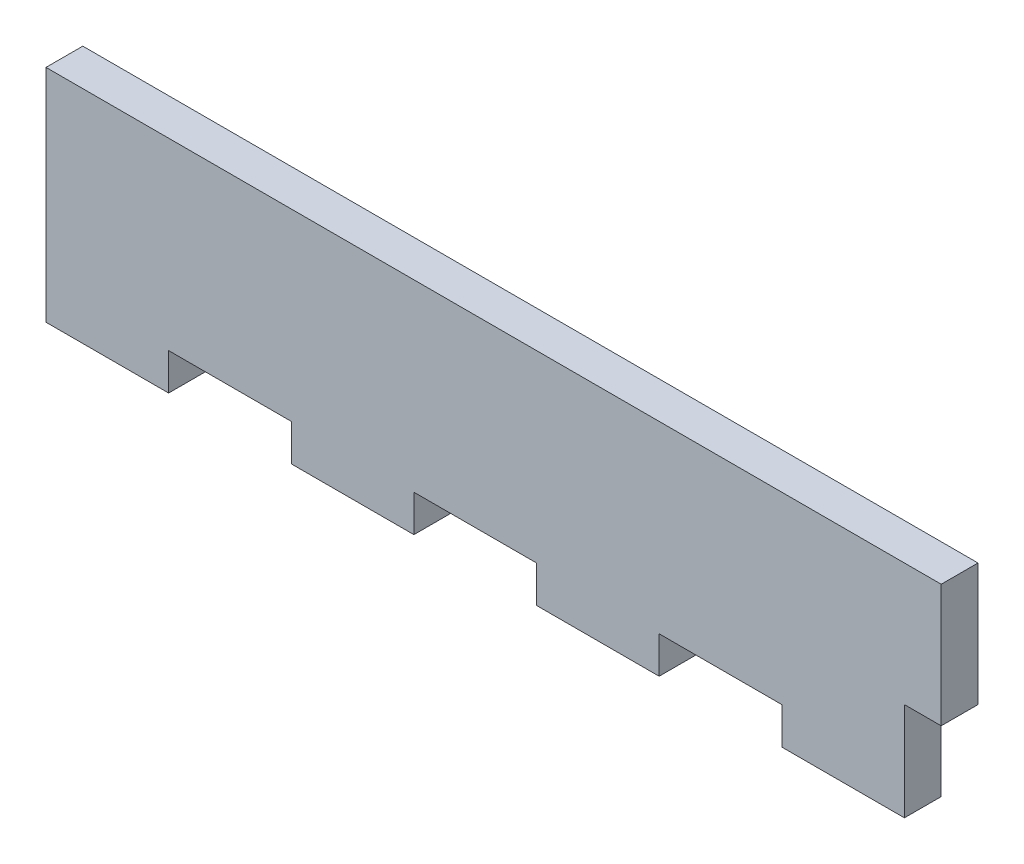
ISO-10303-21;
HEADER;
FILE_DESCRIPTION(('STEP AP214'),'2;1');
FILE_NAME('part.step','',(''),(''),'','','');
FILE_SCHEMA(('AUTOMOTIVE_DESIGN { 1 0 10303 214 1 1 1 1 }'));
ENDSEC;
DATA;
#1=APPLICATION_CONTEXT('core data for automotive mechanical design processes');
#2=APPLICATION_PROTOCOL_DEFINITION('international standard','automotive_design',2000,#1);
#3=PRODUCT_CONTEXT('',#1,'mechanical');
#4=PRODUCT('Part','Part','',(#3));
#5=PRODUCT_RELATED_PRODUCT_CATEGORY('part','',(#4));
#6=PRODUCT_DEFINITION_FORMATION('','',#4);
#7=PRODUCT_DEFINITION_CONTEXT('part definition',#1,'design');
#8=PRODUCT_DEFINITION('design','',#6,#7);
#9=PRODUCT_DEFINITION_SHAPE('','',#8);
#10=(LENGTH_UNIT() NAMED_UNIT(*) SI_UNIT(.MILLI.,.METRE.));
#11=(NAMED_UNIT(*) PLANE_ANGLE_UNIT() SI_UNIT($,.RADIAN.));
#12=(NAMED_UNIT(*) SI_UNIT($,.STERADIAN.) SOLID_ANGLE_UNIT());
#13=UNCERTAINTY_MEASURE_WITH_UNIT(LENGTH_MEASURE(1.E-05),#10,'distance_accuracy_value','');
#14=(GEOMETRIC_REPRESENTATION_CONTEXT(3) GLOBAL_UNCERTAINTY_ASSIGNED_CONTEXT((#13)) GLOBAL_UNIT_ASSIGNED_CONTEXT((#10,
#11,#12)) REPRESENTATION_CONTEXT('',''));
#15=CARTESIAN_POINT('',(0.,0.,0.));
#16=DIRECTION('',(0.,0.,1.));
#17=DIRECTION('',(1.,0.,0.));
#18=AXIS2_PLACEMENT_3D('',#15,#16,#17);
#19=CARTESIAN_POINT('',(70.,0.,3.));
#20=DIRECTION('',(-1.,0.,0.));
#21=DIRECTION('',(0.,0.,1.));
#22=AXIS2_PLACEMENT_3D('',#19,#20,#21);
#23=PLANE('',#22);
#24=DIRECTION('',(0.,0.,-1.));
#25=VECTOR('',#24,1.);
#26=CARTESIAN_POINT('',(70.,-10.,3.));
#27=LINE('',#26,#25);
#28=CARTESIAN_POINT('',(70.,-10.,3.));
#29=VERTEX_POINT('',#28);
#30=CARTESIAN_POINT('',(70.,-10.,0.));
#31=VERTEX_POINT('',#30);
#32=EDGE_CURVE('E50',#29,#31,#27,.T.);
#33=ORIENTED_EDGE('',*,*,#32,.F.);
#34=DIRECTION('',(0.,1.,0.));
#35=VECTOR('',#34,1.);
#36=CARTESIAN_POINT('',(70.,0.,3.));
#37=LINE('',#36,#35);
#38=CARTESIAN_POINT('',(70.,-18.,3.));
#39=VERTEX_POINT('',#38);
#40=EDGE_CURVE('E183',#39,#29,#37,.T.);
#41=ORIENTED_EDGE('',*,*,#40,.F.);
#42=DIRECTION('',(0.,0.,-1.));
#43=VECTOR('',#42,1.);
#44=CARTESIAN_POINT('',(70.,-18.,3.));
#45=LINE('',#44,#43);
#46=CARTESIAN_POINT('',(70.,-18.,0.));
#47=VERTEX_POINT('',#46);
#48=EDGE_CURVE('E43',#39,#47,#45,.T.);
#49=ORIENTED_EDGE('',*,*,#48,.T.);
#50=DIRECTION('',(0.,1.,0.));
#51=VECTOR('',#50,1.);
#52=CARTESIAN_POINT('',(70.,0.,0.));
#53=LINE('',#52,#51);
#54=EDGE_CURVE('E286',#47,#31,#53,.T.);
#55=ORIENTED_EDGE('',*,*,#54,.T.);
#56=EDGE_LOOP('',(#33,#41,#49,#55));
#57=FACE_BOUND('',#56,.T.);
#58=ADVANCED_FACE('F35',(#57),#23,.F.);
#59=CARTESIAN_POINT('',(0.,-18.,3.));
#60=DIRECTION('',(0.,1.,0.));
#61=DIRECTION('',(0.,0.,1.));
#62=AXIS2_PLACEMENT_3D('',#59,#60,#61);
#63=PLANE('',#62);
#64=DIRECTION('',(1.,0.,0.));
#65=VECTOR('',#64,1.);
#66=CARTESIAN_POINT('',(0.,-18.,3.));
#67=LINE('',#66,#65);
#68=CARTESIAN_POINT('',(40.,-18.,3.));
#69=VERTEX_POINT('',#68);
#70=CARTESIAN_POINT('',(50.,-18.,3.));
#71=VERTEX_POINT('',#70);
#72=EDGE_CURVE('E275',#69,#71,#67,.T.);
#73=ORIENTED_EDGE('',*,*,#72,.F.);
#74=DIRECTION('',(0.,0.,1.));
#75=VECTOR('',#74,1.);
#76=CARTESIAN_POINT('',(40.,-18.,0.));
#77=LINE('',#76,#75);
#78=CARTESIAN_POINT('',(40.,-18.,0.));
#79=VERTEX_POINT('',#78);
#80=EDGE_CURVE('E209',#79,#69,#77,.T.);
#81=ORIENTED_EDGE('',*,*,#80,.F.);
#82=DIRECTION('',(1.,0.,0.));
#83=VECTOR('',#82,1.);
#84=CARTESIAN_POINT('',(0.,-18.,0.));
#85=LINE('',#84,#83);
#86=CARTESIAN_POINT('',(50.,-18.,0.));
#87=VERTEX_POINT('',#86);
#88=EDGE_CURVE('E288',#79,#87,#85,.T.);
#89=ORIENTED_EDGE('',*,*,#88,.T.);
#90=DIRECTION('',(0.,0.,1.));
#91=VECTOR('',#90,1.);
#92=CARTESIAN_POINT('',(50.,-18.,0.));
#93=LINE('',#92,#91);
#94=EDGE_CURVE('E260',#87,#71,#93,.T.);
#95=ORIENTED_EDGE('',*,*,#94,.T.);
#96=EDGE_LOOP('',(#73,#81,#89,#95));
#97=FACE_BOUND('',#96,.T.);
#98=ADVANCED_FACE('F346',(#97),#63,.F.);
#99=CARTESIAN_POINT('',(20.,-18.,0.));
#100=VERTEX_POINT('',#99);
#101=CARTESIAN_POINT('',(30.,-18.,0.));
#102=VERTEX_POINT('',#101);
#103=EDGE_CURVE('E287',#100,#102,#85,.T.);
#104=ORIENTED_EDGE('',*,*,#103,.T.);
#105=DIRECTION('',(0.,0.,1.));
#106=VECTOR('',#105,1.);
#107=CARTESIAN_POINT('',(30.,-18.,0.));
#108=LINE('',#107,#106);
#109=CARTESIAN_POINT('',(30.,-18.,3.));
#110=VERTEX_POINT('',#109);
#111=EDGE_CURVE('E212',#102,#110,#108,.T.);
#112=ORIENTED_EDGE('',*,*,#111,.T.);
#113=CARTESIAN_POINT('',(20.,-18.,3.));
#114=VERTEX_POINT('',#113);
#115=EDGE_CURVE('E274',#114,#110,#67,.T.);
#116=ORIENTED_EDGE('',*,*,#115,.F.);
#117=DIRECTION('',(0.,0.,1.));
#118=VECTOR('',#117,1.);
#119=CARTESIAN_POINT('',(20.,-18.,0.));
#120=LINE('',#119,#118);
#121=EDGE_CURVE('E205',#100,#114,#120,.T.);
#122=ORIENTED_EDGE('',*,*,#121,.F.);
#123=EDGE_LOOP('',(#104,#112,#116,#122));
#124=FACE_BOUND('',#123,.T.);
#125=ADVANCED_FACE('F329',(#124),#63,.F.);
#126=CARTESIAN_POINT('',(60.,-18.,3.));
#127=VERTEX_POINT('',#126);
#128=EDGE_CURVE('E269',#127,#39,#67,.T.);
#129=ORIENTED_EDGE('',*,*,#128,.F.);
#130=DIRECTION('',(0.,0.,1.));
#131=VECTOR('',#130,1.);
#132=CARTESIAN_POINT('',(60.,-18.,0.));
#133=LINE('',#132,#131);
#134=CARTESIAN_POINT('',(60.,-18.,0.));
#135=VERTEX_POINT('',#134);
#136=EDGE_CURVE('E257',#135,#127,#133,.T.);
#137=ORIENTED_EDGE('',*,*,#136,.F.);
#138=EDGE_CURVE('E282',#135,#47,#85,.T.);
#139=ORIENTED_EDGE('',*,*,#138,.T.);
#140=ORIENTED_EDGE('',*,*,#48,.F.);
#141=EDGE_LOOP('',(#129,#137,#139,#140));
#142=FACE_BOUND('',#141,.T.);
#143=ADVANCED_FACE('F333',(#142),#63,.F.);
#144=CARTESIAN_POINT('',(0.,0.,3.));
#145=DIRECTION('',(1.,0.,0.));
#146=DIRECTION('',(0.,1.,0.));
#147=AXIS2_PLACEMENT_3D('',#144,#145,#146);
#148=PLANE('',#147);
#149=DIRECTION('',(0.,-1.,0.));
#150=VECTOR('',#149,1.);
#151=CARTESIAN_POINT('',(0.,0.,0.));
#152=LINE('',#151,#150);
#153=CARTESIAN_POINT('',(0.,0.,0.));
#154=VERTEX_POINT('',#153);
#155=CARTESIAN_POINT('',(0.,-18.,0.));
#156=VERTEX_POINT('',#155);
#157=EDGE_CURVE('E259',#154,#156,#152,.T.);
#158=ORIENTED_EDGE('',*,*,#157,.T.);
#159=DIRECTION('',(0.,0.,-1.));
#160=VECTOR('',#159,1.);
#161=CARTESIAN_POINT('',(0.,-18.,3.));
#162=LINE('',#161,#160);
#163=CARTESIAN_POINT('',(0.,-18.,3.));
#164=VERTEX_POINT('',#163);
#165=EDGE_CURVE('E11',#164,#156,#162,.T.);
#166=ORIENTED_EDGE('',*,*,#165,.F.);
#167=DIRECTION('',(0.,-1.,0.));
#168=VECTOR('',#167,1.);
#169=CARTESIAN_POINT('',(0.,0.,3.));
#170=LINE('',#169,#168);
#171=CARTESIAN_POINT('',(0.,0.,3.));
#172=VERTEX_POINT('',#171);
#173=EDGE_CURVE('E266',#172,#164,#170,.T.);
#174=ORIENTED_EDGE('',*,*,#173,.F.);
#175=DIRECTION('',(0.,0.,-1.));
#176=VECTOR('',#175,1.);
#177=CARTESIAN_POINT('',(0.,0.,3.));
#178=LINE('',#177,#176);
#179=EDGE_CURVE('E279',#172,#154,#178,.T.);
#180=ORIENTED_EDGE('',*,*,#179,.T.);
#181=EDGE_LOOP('',(#158,#166,#174,#180));
#182=FACE_BOUND('',#181,.T.);
#183=ADVANCED_FACE('F37',(#182),#148,.F.);
#184=CARTESIAN_POINT('',(10.,-18.,0.));
#185=VERTEX_POINT('',#184);
#186=EDGE_CURVE('E283',#156,#185,#85,.T.);
#187=ORIENTED_EDGE('',*,*,#186,.T.);
#188=DIRECTION('',(0.,0.,1.));
#189=VECTOR('',#188,1.);
#190=CARTESIAN_POINT('',(10.,-18.,0.));
#191=LINE('',#190,#189);
#192=CARTESIAN_POINT('',(10.,-18.,3.));
#193=VERTEX_POINT('',#192);
#194=EDGE_CURVE('E233',#185,#193,#191,.T.);
#195=ORIENTED_EDGE('',*,*,#194,.T.);
#196=EDGE_CURVE('E271',#164,#193,#67,.T.);
#197=ORIENTED_EDGE('',*,*,#196,.F.);
#198=ORIENTED_EDGE('',*,*,#165,.T.);
#199=EDGE_LOOP('',(#187,#195,#197,#198));
#200=FACE_BOUND('',#199,.T.);
#201=ADVANCED_FACE('F312',(#200),#63,.F.);
#202=CARTESIAN_POINT('',(0.,0.,3.));
#203=DIRECTION('',(0.,-1.,0.));
#204=DIRECTION('',(0.,0.,-1.));
#205=AXIS2_PLACEMENT_3D('',#202,#203,#204);
#206=PLANE('',#205);
#207=DIRECTION('',(-1.,0.,0.));
#208=VECTOR('',#207,1.);
#209=CARTESIAN_POINT('',(0.,0.,0.));
#210=LINE('',#209,#208);
#211=CARTESIAN_POINT('',(73.,0.,0.));
#212=VERTEX_POINT('',#211);
#213=EDGE_CURVE('E270',#212,#154,#210,.T.);
#214=ORIENTED_EDGE('',*,*,#213,.T.);
#215=ORIENTED_EDGE('',*,*,#179,.F.);
#216=DIRECTION('',(-1.,0.,0.));
#217=VECTOR('',#216,1.);
#218=CARTESIAN_POINT('',(0.,0.,3.));
#219=LINE('',#218,#217);
#220=CARTESIAN_POINT('',(73.,0.,3.));
#221=VERTEX_POINT('',#220);
#222=EDGE_CURVE('E277',#221,#172,#219,.T.);
#223=ORIENTED_EDGE('',*,*,#222,.F.);
#224=DIRECTION('',(0.,0.,1.));
#225=VECTOR('',#224,1.);
#226=CARTESIAN_POINT('',(73.,0.,3.));
#227=LINE('',#226,#225);
#228=EDGE_CURVE('E178',#212,#221,#227,.T.);
#229=ORIENTED_EDGE('',*,*,#228,.F.);
#230=EDGE_LOOP('',(#214,#215,#223,#229));
#231=FACE_BOUND('',#230,.T.);
#232=ADVANCED_FACE('F305',(#231),#206,.F.);
#233=CARTESIAN_POINT('',(0.,0.,3.));
#234=DIRECTION('',(0.,0.,1.));
#235=DIRECTION('',(1.,0.,0.));
#236=AXIS2_PLACEMENT_3D('',#233,#234,#235);
#237=PLANE('',#236);
#238=DIRECTION('',(0.,1.,0.));
#239=VECTOR('',#238,1.);
#240=CARTESIAN_POINT('',(40.,-18.,3.));
#241=LINE('',#240,#239);
#242=CARTESIAN_POINT('',(40.,-15.,3.));
#243=VERTEX_POINT('',#242);
#244=EDGE_CURVE('E201',#69,#243,#241,.T.);
#245=ORIENTED_EDGE('',*,*,#244,.F.);
#246=ORIENTED_EDGE('',*,*,#72,.T.);
#247=DIRECTION('',(0.,-1.,0.));
#248=VECTOR('',#247,1.);
#249=CARTESIAN_POINT('',(50.,-18.,3.));
#250=LINE('',#249,#248);
#251=CARTESIAN_POINT('',(50.,-15.,3.));
#252=VERTEX_POINT('',#251);
#253=EDGE_CURVE('E243',#252,#71,#250,.T.);
#254=ORIENTED_EDGE('',*,*,#253,.F.);
#255=DIRECTION('',(-1.,0.,0.));
#256=VECTOR('',#255,1.);
#257=CARTESIAN_POINT('',(60.,-15.,3.));
#258=LINE('',#257,#256);
#259=CARTESIAN_POINT('',(60.,-15.,3.));
#260=VERTEX_POINT('',#259);
#261=EDGE_CURVE('E252',#260,#252,#258,.T.);
#262=ORIENTED_EDGE('',*,*,#261,.F.);
#263=DIRECTION('',(0.,1.,0.));
#264=VECTOR('',#263,1.);
#265=CARTESIAN_POINT('',(60.,-18.,3.));
#266=LINE('',#265,#264);
#267=EDGE_CURVE('E211',#127,#260,#266,.T.);
#268=ORIENTED_EDGE('',*,*,#267,.F.);
#269=ORIENTED_EDGE('',*,*,#128,.T.);
#270=ORIENTED_EDGE('',*,*,#40,.T.);
#271=DIRECTION('',(-1.,0.,0.));
#272=VECTOR('',#271,1.);
#273=CARTESIAN_POINT('',(73.,-10.,3.));
#274=LINE('',#273,#272);
#275=CARTESIAN_POINT('',(73.,-10.,3.));
#276=VERTEX_POINT('',#275);
#277=EDGE_CURVE('E165',#276,#29,#274,.T.);
#278=ORIENTED_EDGE('',*,*,#277,.F.);
#279=DIRECTION('',(0.,-1.,0.));
#280=VECTOR('',#279,1.);
#281=CARTESIAN_POINT('',(73.,0.,3.));
#282=LINE('',#281,#280);
#283=EDGE_CURVE('E172',#221,#276,#282,.T.);
#284=ORIENTED_EDGE('',*,*,#283,.F.);
#285=ORIENTED_EDGE('',*,*,#222,.T.);
#286=ORIENTED_EDGE('',*,*,#173,.T.);
#287=ORIENTED_EDGE('',*,*,#196,.T.);
#288=DIRECTION('',(0.,-1.,0.));
#289=VECTOR('',#288,1.);
#290=CARTESIAN_POINT('',(10.,-18.,3.));
#291=LINE('',#290,#289);
#292=CARTESIAN_POINT('',(10.,-15.,3.));
#293=VERTEX_POINT('',#292);
#294=EDGE_CURVE('E222',#293,#193,#291,.T.);
#295=ORIENTED_EDGE('',*,*,#294,.F.);
#296=DIRECTION('',(-1.,0.,0.));
#297=VECTOR('',#296,1.);
#298=CARTESIAN_POINT('',(20.,-15.,3.));
#299=LINE('',#298,#297);
#300=CARTESIAN_POINT('',(20.,-15.,3.));
#301=VERTEX_POINT('',#300);
#302=EDGE_CURVE('E187',#301,#293,#299,.T.);
#303=ORIENTED_EDGE('',*,*,#302,.F.);
#304=DIRECTION('',(0.,1.,0.));
#305=VECTOR('',#304,1.);
#306=CARTESIAN_POINT('',(20.,-18.,3.));
#307=LINE('',#306,#305);
#308=EDGE_CURVE('E184',#114,#301,#307,.T.);
#309=ORIENTED_EDGE('',*,*,#308,.F.);
#310=ORIENTED_EDGE('',*,*,#115,.T.);
#311=DIRECTION('',(0.,-1.,0.));
#312=VECTOR('',#311,1.);
#313=CARTESIAN_POINT('',(30.,-18.,3.));
#314=LINE('',#313,#312);
#315=CARTESIAN_POINT('',(30.,-15.,3.));
#316=VERTEX_POINT('',#315);
#317=EDGE_CURVE('E196',#316,#110,#314,.T.);
#318=ORIENTED_EDGE('',*,*,#317,.F.);
#319=DIRECTION('',(-1.,0.,0.));
#320=VECTOR('',#319,1.);
#321=CARTESIAN_POINT('',(40.,-15.,3.));
#322=LINE('',#321,#320);
#323=EDGE_CURVE('E204',#243,#316,#322,.T.);
#324=ORIENTED_EDGE('',*,*,#323,.F.);
#325=EDGE_LOOP('',(#245,#246,#254,#262,#268,#269,#270,#278,#284,#285,#286,#287,#295,#303,#309,
#310,#318,#324));
#326=FACE_BOUND('',#325,.T.);
#327=ADVANCED_FACE('F182',(#326),#237,.T.);
#328=CARTESIAN_POINT('',(0.,0.,0.));
#329=DIRECTION('',(0.,0.,1.));
#330=DIRECTION('',(1.,0.,0.));
#331=AXIS2_PLACEMENT_3D('',#328,#329,#330);
#332=PLANE('',#331);
#333=ORIENTED_EDGE('',*,*,#88,.F.);
#334=DIRECTION('',(0.,1.,0.));
#335=VECTOR('',#334,1.);
#336=CARTESIAN_POINT('',(40.,-18.,0.));
#337=LINE('',#336,#335);
#338=CARTESIAN_POINT('',(40.,-15.,0.));
#339=VERTEX_POINT('',#338);
#340=EDGE_CURVE('E192',#79,#339,#337,.T.);
#341=ORIENTED_EDGE('',*,*,#340,.T.);
#342=DIRECTION('',(-1.,0.,0.));
#343=VECTOR('',#342,1.);
#344=CARTESIAN_POINT('',(40.,-15.,0.));
#345=LINE('',#344,#343);
#346=CARTESIAN_POINT('',(30.,-15.,0.));
#347=VERTEX_POINT('',#346);
#348=EDGE_CURVE('E195',#339,#347,#345,.T.);
#349=ORIENTED_EDGE('',*,*,#348,.T.);
#350=DIRECTION('',(0.,-1.,0.));
#351=VECTOR('',#350,1.);
#352=CARTESIAN_POINT('',(30.,-18.,0.));
#353=LINE('',#352,#351);
#354=EDGE_CURVE('E58',#347,#102,#353,.T.);
#355=ORIENTED_EDGE('',*,*,#354,.T.);
#356=ORIENTED_EDGE('',*,*,#103,.F.);
#357=DIRECTION('',(0.,1.,0.));
#358=VECTOR('',#357,1.);
#359=CARTESIAN_POINT('',(20.,-18.,0.));
#360=LINE('',#359,#358);
#361=CARTESIAN_POINT('',(20.,-15.,0.));
#362=VERTEX_POINT('',#361);
#363=EDGE_CURVE('E218',#100,#362,#360,.T.);
#364=ORIENTED_EDGE('',*,*,#363,.T.);
#365=DIRECTION('',(-1.,0.,0.));
#366=VECTOR('',#365,1.);
#367=CARTESIAN_POINT('',(20.,-15.,0.));
#368=LINE('',#367,#366);
#369=CARTESIAN_POINT('',(10.,-15.,0.));
#370=VERTEX_POINT('',#369);
#371=EDGE_CURVE('E221',#362,#370,#368,.T.);
#372=ORIENTED_EDGE('',*,*,#371,.T.);
#373=DIRECTION('',(0.,-1.,0.));
#374=VECTOR('',#373,1.);
#375=CARTESIAN_POINT('',(10.,-18.,0.));
#376=LINE('',#375,#374);
#377=EDGE_CURVE('E225',#370,#185,#376,.T.);
#378=ORIENTED_EDGE('',*,*,#377,.T.);
#379=ORIENTED_EDGE('',*,*,#186,.F.);
#380=ORIENTED_EDGE('',*,*,#157,.F.);
#381=ORIENTED_EDGE('',*,*,#213,.F.);
#382=DIRECTION('',(0.,1.,0.));
#383=VECTOR('',#382,1.);
#384=CARTESIAN_POINT('',(73.,0.,0.));
#385=LINE('',#384,#383);
#386=CARTESIAN_POINT('',(73.,-10.,0.));
#387=VERTEX_POINT('',#386);
#388=EDGE_CURVE('E171',#387,#212,#385,.T.);
#389=ORIENTED_EDGE('',*,*,#388,.F.);
#390=DIRECTION('',(-1.,0.,0.));
#391=VECTOR('',#390,1.);
#392=CARTESIAN_POINT('',(73.,-10.,0.));
#393=LINE('',#392,#391);
#394=EDGE_CURVE('E167',#387,#31,#393,.T.);
#395=ORIENTED_EDGE('',*,*,#394,.T.);
#396=ORIENTED_EDGE('',*,*,#54,.F.);
#397=ORIENTED_EDGE('',*,*,#138,.F.);
#398=DIRECTION('',(0.,1.,0.));
#399=VECTOR('',#398,1.);
#400=CARTESIAN_POINT('',(60.,-18.,0.));
#401=LINE('',#400,#399);
#402=CARTESIAN_POINT('',(60.,-15.,0.));
#403=VERTEX_POINT('',#402);
#404=EDGE_CURVE('E239',#135,#403,#401,.T.);
#405=ORIENTED_EDGE('',*,*,#404,.T.);
#406=DIRECTION('',(-1.,0.,0.));
#407=VECTOR('',#406,1.);
#408=CARTESIAN_POINT('',(60.,-15.,0.));
#409=LINE('',#408,#407);
#410=CARTESIAN_POINT('',(50.,-15.,0.));
#411=VERTEX_POINT('',#410);
#412=EDGE_CURVE('E242',#403,#411,#409,.T.);
#413=ORIENTED_EDGE('',*,*,#412,.T.);
#414=DIRECTION('',(0.,-1.,0.));
#415=VECTOR('',#414,1.);
#416=CARTESIAN_POINT('',(50.,-18.,0.));
#417=LINE('',#416,#415);
#418=EDGE_CURVE('E246',#411,#87,#417,.T.);
#419=ORIENTED_EDGE('',*,*,#418,.T.);
#420=EDGE_LOOP('',(#333,#341,#349,#355,#356,#364,#372,#378,#379,#380,#381,#389,#395,#396,#397,
#405,#413,#419));
#421=FACE_BOUND('',#420,.T.);
#422=ADVANCED_FACE('F300',(#421),#332,.F.);
#423=CARTESIAN_POINT('',(60.,-18.,0.));
#424=DIRECTION('',(1.,0.,0.));
#425=DIRECTION('',(0.,0.,-1.));
#426=AXIS2_PLACEMENT_3D('',#423,#424,#425);
#427=PLANE('',#426);
#428=ORIENTED_EDGE('',*,*,#267,.T.);
#429=DIRECTION('',(0.,0.,1.));
#430=VECTOR('',#429,1.);
#431=CARTESIAN_POINT('',(60.,-15.,0.));
#432=LINE('',#431,#430);
#433=EDGE_CURVE('E249',#403,#260,#432,.T.);
#434=ORIENTED_EDGE('',*,*,#433,.F.);
#435=ORIENTED_EDGE('',*,*,#404,.F.);
#436=ORIENTED_EDGE('',*,*,#136,.T.);
#437=EDGE_LOOP('',(#428,#434,#435,#436));
#438=FACE_BOUND('',#437,.T.);
#439=ADVANCED_FACE('F335',(#438),#427,.F.);
#440=CARTESIAN_POINT('',(50.,-18.,0.));
#441=DIRECTION('',(-1.,0.,0.));
#442=DIRECTION('',(0.,0.,1.));
#443=AXIS2_PLACEMENT_3D('',#440,#441,#442);
#444=PLANE('',#443);
#445=ORIENTED_EDGE('',*,*,#253,.T.);
#446=ORIENTED_EDGE('',*,*,#94,.F.);
#447=ORIENTED_EDGE('',*,*,#418,.F.);
#448=DIRECTION('',(0.,0.,1.));
#449=VECTOR('',#448,1.);
#450=CARTESIAN_POINT('',(50.,-15.,0.));
#451=LINE('',#450,#449);
#452=EDGE_CURVE('E263',#411,#252,#451,.T.);
#453=ORIENTED_EDGE('',*,*,#452,.T.);
#454=EDGE_LOOP('',(#445,#446,#447,#453));
#455=FACE_BOUND('',#454,.T.);
#456=ADVANCED_FACE('F342',(#455),#444,.F.);
#457=CARTESIAN_POINT('',(60.,-15.,0.));
#458=DIRECTION('',(0.,1.,0.));
#459=DIRECTION('',(-1.,0.,0.));
#460=AXIS2_PLACEMENT_3D('',#457,#458,#459);
#461=PLANE('',#460);
#462=ORIENTED_EDGE('',*,*,#261,.T.);
#463=ORIENTED_EDGE('',*,*,#452,.F.);
#464=ORIENTED_EDGE('',*,*,#412,.F.);
#465=ORIENTED_EDGE('',*,*,#433,.T.);
#466=EDGE_LOOP('',(#462,#463,#464,#465));
#467=FACE_BOUND('',#466,.T.);
#468=ADVANCED_FACE('F339',(#467),#461,.F.);
#469=CARTESIAN_POINT('',(20.,-18.,0.));
#470=DIRECTION('',(1.,0.,0.));
#471=DIRECTION('',(0.,0.,-1.));
#472=AXIS2_PLACEMENT_3D('',#469,#470,#471);
#473=PLANE('',#472);
#474=ORIENTED_EDGE('',*,*,#308,.T.);
#475=DIRECTION('',(0.,0.,1.));
#476=VECTOR('',#475,1.);
#477=CARTESIAN_POINT('',(20.,-15.,0.));
#478=LINE('',#477,#476);
#479=EDGE_CURVE('E227',#362,#301,#478,.T.);
#480=ORIENTED_EDGE('',*,*,#479,.F.);
#481=ORIENTED_EDGE('',*,*,#363,.F.);
#482=ORIENTED_EDGE('',*,*,#121,.T.);
#483=EDGE_LOOP('',(#474,#480,#481,#482));
#484=FACE_BOUND('',#483,.T.);
#485=ADVANCED_FACE('F397',(#484),#473,.F.);
#486=CARTESIAN_POINT('',(10.,-18.,0.));
#487=DIRECTION('',(-1.,0.,0.));
#488=DIRECTION('',(0.,0.,1.));
#489=AXIS2_PLACEMENT_3D('',#486,#487,#488);
#490=PLANE('',#489);
#491=ORIENTED_EDGE('',*,*,#294,.T.);
#492=ORIENTED_EDGE('',*,*,#194,.F.);
#493=ORIENTED_EDGE('',*,*,#377,.F.);
#494=DIRECTION('',(0.,0.,1.));
#495=VECTOR('',#494,1.);
#496=CARTESIAN_POINT('',(10.,-15.,0.));
#497=LINE('',#496,#495);
#498=EDGE_CURVE('E236',#370,#293,#497,.T.);
#499=ORIENTED_EDGE('',*,*,#498,.T.);
#500=EDGE_LOOP('',(#491,#492,#493,#499));
#501=FACE_BOUND('',#500,.T.);
#502=ADVANCED_FACE('F314',(#501),#490,.F.);
#503=CARTESIAN_POINT('',(20.,-15.,0.));
#504=DIRECTION('',(0.,1.,0.));
#505=DIRECTION('',(-1.,0.,0.));
#506=AXIS2_PLACEMENT_3D('',#503,#504,#505);
#507=PLANE('',#506);
#508=ORIENTED_EDGE('',*,*,#302,.T.);
#509=ORIENTED_EDGE('',*,*,#498,.F.);
#510=ORIENTED_EDGE('',*,*,#371,.F.);
#511=ORIENTED_EDGE('',*,*,#479,.T.);
#512=EDGE_LOOP('',(#508,#509,#510,#511));
#513=FACE_BOUND('',#512,.T.);
#514=ADVANCED_FACE('F319',(#513),#507,.F.);
#515=CARTESIAN_POINT('',(40.,-18.,0.));
#516=DIRECTION('',(1.,0.,0.));
#517=DIRECTION('',(0.,0.,-1.));
#518=AXIS2_PLACEMENT_3D('',#515,#516,#517);
#519=PLANE('',#518);
#520=ORIENTED_EDGE('',*,*,#244,.T.);
#521=DIRECTION('',(0.,0.,1.));
#522=VECTOR('',#521,1.);
#523=CARTESIAN_POINT('',(40.,-15.,0.));
#524=LINE('',#523,#522);
#525=EDGE_CURVE('E200',#339,#243,#524,.T.);
#526=ORIENTED_EDGE('',*,*,#525,.F.);
#527=ORIENTED_EDGE('',*,*,#340,.F.);
#528=ORIENTED_EDGE('',*,*,#80,.T.);
#529=EDGE_LOOP('',(#520,#526,#527,#528));
#530=FACE_BOUND('',#529,.T.);
#531=ADVANCED_FACE('F354',(#530),#519,.F.);
#532=CARTESIAN_POINT('',(30.,-18.,0.));
#533=DIRECTION('',(-1.,0.,0.));
#534=DIRECTION('',(0.,0.,1.));
#535=AXIS2_PLACEMENT_3D('',#532,#533,#534);
#536=PLANE('',#535);
#537=ORIENTED_EDGE('',*,*,#317,.T.);
#538=ORIENTED_EDGE('',*,*,#111,.F.);
#539=ORIENTED_EDGE('',*,*,#354,.F.);
#540=DIRECTION('',(0.,0.,1.));
#541=VECTOR('',#540,1.);
#542=CARTESIAN_POINT('',(30.,-15.,0.));
#543=LINE('',#542,#541);
#544=EDGE_CURVE('E215',#347,#316,#543,.T.);
#545=ORIENTED_EDGE('',*,*,#544,.T.);
#546=EDGE_LOOP('',(#537,#538,#539,#545));
#547=FACE_BOUND('',#546,.T.);
#548=ADVANCED_FACE('F352',(#547),#536,.F.);
#549=CARTESIAN_POINT('',(40.,-15.,0.));
#550=DIRECTION('',(0.,1.,0.));
#551=DIRECTION('',(-1.,0.,0.));
#552=AXIS2_PLACEMENT_3D('',#549,#550,#551);
#553=PLANE('',#552);
#554=ORIENTED_EDGE('',*,*,#323,.T.);
#555=ORIENTED_EDGE('',*,*,#544,.F.);
#556=ORIENTED_EDGE('',*,*,#348,.F.);
#557=ORIENTED_EDGE('',*,*,#525,.T.);
#558=EDGE_LOOP('',(#554,#555,#556,#557));
#559=FACE_BOUND('',#558,.T.);
#560=ADVANCED_FACE('F350',(#559),#553,.F.);
#561=CARTESIAN_POINT('',(73.,-10.,3.));
#562=DIRECTION('',(0.,1.,0.));
#563=DIRECTION('',(0.,0.,1.));
#564=AXIS2_PLACEMENT_3D('',#561,#562,#563);
#565=PLANE('',#564);
#566=ORIENTED_EDGE('',*,*,#32,.T.);
#567=ORIENTED_EDGE('',*,*,#394,.F.);
#568=DIRECTION('',(0.,0.,-1.));
#569=VECTOR('',#568,1.);
#570=CARTESIAN_POINT('',(73.,-10.,3.));
#571=LINE('',#570,#569);
#572=EDGE_CURVE('E161',#276,#387,#571,.T.);
#573=ORIENTED_EDGE('',*,*,#572,.F.);
#574=ORIENTED_EDGE('',*,*,#277,.T.);
#575=EDGE_LOOP('',(#566,#567,#573,#574));
#576=FACE_BOUND('',#575,.T.);
#577=ADVANCED_FACE('F163',(#576),#565,.F.);
#578=CARTESIAN_POINT('',(73.,0.,0.));
#579=DIRECTION('',(1.,0.,0.));
#580=DIRECTION('',(0.,0.,-1.));
#581=AXIS2_PLACEMENT_3D('',#578,#579,#580);
#582=PLANE('',#581);
#583=ORIENTED_EDGE('',*,*,#283,.T.);
#584=ORIENTED_EDGE('',*,*,#572,.T.);
#585=ORIENTED_EDGE('',*,*,#388,.T.);
#586=ORIENTED_EDGE('',*,*,#228,.T.);
#587=EDGE_LOOP('',(#583,#584,#585,#586));
#588=FACE_BOUND('',#587,.T.);
#589=ADVANCED_FACE('F176',(#588),#582,.T.);
#590=CLOSED_SHELL('',(#58,#98,#125,#143,#183,#201,#232,#327,#422,#439,#456,#468,#485,#502,#514,
#531,#548,#560,#577,#589));
#591=MANIFOLD_SOLID_BREP('B2',#590);
#592=ADVANCED_BREP_SHAPE_REPRESENTATION('',(#18,#591),#14);
#593=SHAPE_DEFINITION_REPRESENTATION(#9,#592);
ENDSEC;
END-ISO-10303-21;
